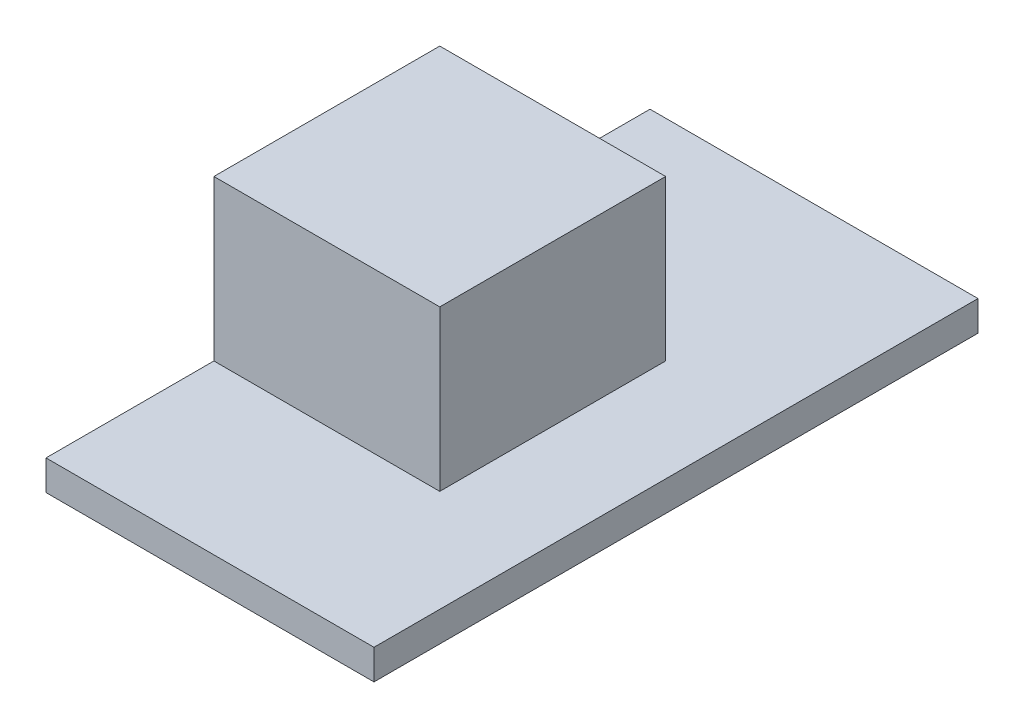
ISO-10303-21;
HEADER;
FILE_DESCRIPTION(('STEP AP214'),'2;1');
FILE_NAME('part.step','',(''),(''),'','','');
FILE_SCHEMA(('AUTOMOTIVE_DESIGN { 1 0 10303 214 1 1 1 1 }'));
ENDSEC;
DATA;
#1=APPLICATION_CONTEXT('core data for automotive mechanical design processes');
#2=APPLICATION_PROTOCOL_DEFINITION('international standard','automotive_design',2000,#1);
#3=PRODUCT_CONTEXT('',#1,'mechanical');
#4=PRODUCT('Part','Part','',(#3));
#5=PRODUCT_RELATED_PRODUCT_CATEGORY('part','',(#4));
#6=PRODUCT_DEFINITION_FORMATION('','',#4);
#7=PRODUCT_DEFINITION_CONTEXT('part definition',#1,'design');
#8=PRODUCT_DEFINITION('design','',#6,#7);
#9=PRODUCT_DEFINITION_SHAPE('','',#8);
#10=(LENGTH_UNIT() NAMED_UNIT(*) SI_UNIT(.MILLI.,.METRE.));
#11=(NAMED_UNIT(*) PLANE_ANGLE_UNIT() SI_UNIT($,.RADIAN.));
#12=(NAMED_UNIT(*) SI_UNIT($,.STERADIAN.) SOLID_ANGLE_UNIT());
#13=UNCERTAINTY_MEASURE_WITH_UNIT(LENGTH_MEASURE(1.E-05),#10,'distance_accuracy_value','');
#14=(GEOMETRIC_REPRESENTATION_CONTEXT(3) GLOBAL_UNCERTAINTY_ASSIGNED_CONTEXT((#13)) GLOBAL_UNIT_ASSIGNED_CONTEXT((#10,
#11,#12)) REPRESENTATION_CONTEXT('',''));
#15=CARTESIAN_POINT('',(0.,0.,0.));
#16=DIRECTION('',(0.,0.,1.));
#17=DIRECTION('',(1.,0.,0.));
#18=AXIS2_PLACEMENT_3D('',#15,#16,#17);
#19=CARTESIAN_POINT('',(5.46,1.,-10.055));
#20=DIRECTION('',(-1.,0.,0.));
#21=DIRECTION('',(0.,0.,1.));
#22=AXIS2_PLACEMENT_3D('',#19,#20,#21);
#23=PLANE('',#22);
#24=DIRECTION('',(0.,0.,-1.));
#25=VECTOR('',#24,1.);
#26=CARTESIAN_POINT('',(5.46,0.,-10.055));
#27=LINE('',#26,#25);
#28=CARTESIAN_POINT('',(5.46,0.,10.055));
#29=VERTEX_POINT('',#28);
#30=CARTESIAN_POINT('',(5.46,0.,-10.055));
#31=VERTEX_POINT('',#30);
#32=EDGE_CURVE('E119',#29,#31,#27,.T.);
#33=ORIENTED_EDGE('',*,*,#32,.T.);
#34=DIRECTION('',(0.,-1.,0.));
#35=VECTOR('',#34,1.);
#36=CARTESIAN_POINT('',(5.46,1.,-10.055));
#37=LINE('',#36,#35);
#38=CARTESIAN_POINT('',(5.46,1.,-10.055));
#39=VERTEX_POINT('',#38);
#40=EDGE_CURVE('E11',#39,#31,#37,.T.);
#41=ORIENTED_EDGE('',*,*,#40,.F.);
#42=DIRECTION('',(0.,0.,-1.));
#43=VECTOR('',#42,1.);
#44=CARTESIAN_POINT('',(5.46,1.,-10.055));
#45=LINE('',#44,#43);
#46=CARTESIAN_POINT('',(5.46,1.,10.055));
#47=VERTEX_POINT('',#46);
#48=EDGE_CURVE('E128',#47,#39,#45,.T.);
#49=ORIENTED_EDGE('',*,*,#48,.F.);
#50=DIRECTION('',(0.,-1.,0.));
#51=VECTOR('',#50,1.);
#52=CARTESIAN_POINT('',(5.46,1.,10.055));
#53=LINE('',#52,#51);
#54=EDGE_CURVE('E137',#47,#29,#53,.T.);
#55=ORIENTED_EDGE('',*,*,#54,.T.);
#56=EDGE_LOOP('',(#33,#41,#49,#55));
#57=FACE_BOUND('',#56,.T.);
#58=ADVANCED_FACE('F33',(#57),#23,.F.);
#59=CARTESIAN_POINT('',(-5.46,1.,-10.055));
#60=DIRECTION('',(0.,0.,1.));
#61=DIRECTION('',(1.,0.,0.));
#62=AXIS2_PLACEMENT_3D('',#59,#60,#61);
#63=PLANE('',#62);
#64=DIRECTION('',(-1.,0.,0.));
#65=VECTOR('',#64,1.);
#66=CARTESIAN_POINT('',(-5.46,0.,-10.055));
#67=LINE('',#66,#65);
#68=CARTESIAN_POINT('',(-5.46,0.,-10.055));
#69=VERTEX_POINT('',#68);
#70=EDGE_CURVE('E122',#31,#69,#67,.T.);
#71=ORIENTED_EDGE('',*,*,#70,.T.);
#72=DIRECTION('',(0.,-1.,0.));
#73=VECTOR('',#72,1.);
#74=CARTESIAN_POINT('',(-5.46,1.,-10.055));
#75=LINE('',#74,#73);
#76=CARTESIAN_POINT('',(-5.46,1.,-10.055));
#77=VERTEX_POINT('',#76);
#78=EDGE_CURVE('E40',#77,#69,#75,.T.);
#79=ORIENTED_EDGE('',*,*,#78,.F.);
#80=DIRECTION('',(-1.,0.,0.));
#81=VECTOR('',#80,1.);
#82=CARTESIAN_POINT('',(-5.46,1.,-10.055));
#83=LINE('',#82,#81);
#84=EDGE_CURVE('E131',#39,#77,#83,.T.);
#85=ORIENTED_EDGE('',*,*,#84,.F.);
#86=ORIENTED_EDGE('',*,*,#40,.T.);
#87=EDGE_LOOP('',(#71,#79,#85,#86));
#88=FACE_BOUND('',#87,.T.);
#89=ADVANCED_FACE('F164',(#88),#63,.F.);
#90=CARTESIAN_POINT('',(-5.46,1.,-10.055));
#91=DIRECTION('',(1.,0.,0.));
#92=DIRECTION('',(0.,0.,-1.));
#93=AXIS2_PLACEMENT_3D('',#90,#91,#92);
#94=PLANE('',#93);
#95=DIRECTION('',(0.,0.,1.));
#96=VECTOR('',#95,1.);
#97=CARTESIAN_POINT('',(-5.46,0.,-10.055));
#98=LINE('',#97,#96);
#99=CARTESIAN_POINT('',(-5.46,0.,10.055));
#100=VERTEX_POINT('',#99);
#101=EDGE_CURVE('E140',#69,#100,#98,.T.);
#102=ORIENTED_EDGE('',*,*,#101,.T.);
#103=DIRECTION('',(0.,-1.,0.));
#104=VECTOR('',#103,1.);
#105=CARTESIAN_POINT('',(-5.46,1.,10.055));
#106=LINE('',#105,#104);
#107=CARTESIAN_POINT('',(-5.46,1.,10.055));
#108=VERTEX_POINT('',#107);
#109=EDGE_CURVE('E145',#108,#100,#106,.T.);
#110=ORIENTED_EDGE('',*,*,#109,.F.);
#111=DIRECTION('',(0.,0.,1.));
#112=VECTOR('',#111,1.);
#113=CARTESIAN_POINT('',(-5.46,1.,-10.055));
#114=LINE('',#113,#112);
#115=CARTESIAN_POINT('',(-5.46,1.,4.465));
#116=VERTEX_POINT('',#115);
#117=EDGE_CURVE('E118',#116,#108,#114,.T.);
#118=ORIENTED_EDGE('',*,*,#117,.F.);
#119=DIRECTION('',(0.,-1.,0.));
#120=VECTOR('',#119,1.);
#121=CARTESIAN_POINT('',(-5.46,6.32,4.465));
#122=LINE('',#121,#120);
#123=CARTESIAN_POINT('',(-5.46,6.32,4.465));
#124=VERTEX_POINT('',#123);
#125=EDGE_CURVE('E100',#124,#116,#122,.T.);
#126=ORIENTED_EDGE('',*,*,#125,.F.);
#127=DIRECTION('',(0.,0.,1.));
#128=VECTOR('',#127,1.);
#129=CARTESIAN_POINT('',(-5.46,6.32,4.465));
#130=LINE('',#129,#128);
#131=CARTESIAN_POINT('',(-5.46,6.32,-3.055));
#132=VERTEX_POINT('',#131);
#133=EDGE_CURVE('E106',#132,#124,#130,.T.);
#134=ORIENTED_EDGE('',*,*,#133,.F.);
#135=DIRECTION('',(0.,-1.,0.));
#136=VECTOR('',#135,1.);
#137=CARTESIAN_POINT('',(-5.46,6.32,-3.055));
#138=LINE('',#137,#136);
#139=CARTESIAN_POINT('',(-5.46,1.,-3.055));
#140=VERTEX_POINT('',#139);
#141=EDGE_CURVE('E251',#132,#140,#138,.T.);
#142=ORIENTED_EDGE('',*,*,#141,.T.);
#143=EDGE_CURVE('E134',#77,#140,#114,.T.);
#144=ORIENTED_EDGE('',*,*,#143,.F.);
#145=ORIENTED_EDGE('',*,*,#78,.T.);
#146=EDGE_LOOP('',(#102,#110,#118,#126,#134,#142,#144,#145));
#147=FACE_BOUND('',#146,.T.);
#148=ADVANCED_FACE('F116',(#147),#94,.F.);
#149=CARTESIAN_POINT('',(-5.46,1.,10.055));
#150=DIRECTION('',(0.,0.,-1.));
#151=DIRECTION('',(-1.,0.,0.));
#152=AXIS2_PLACEMENT_3D('',#149,#150,#151);
#153=PLANE('',#152);
#154=DIRECTION('',(1.,0.,0.));
#155=VECTOR('',#154,1.);
#156=CARTESIAN_POINT('',(-5.46,0.,10.055));
#157=LINE('',#156,#155);
#158=EDGE_CURVE('E132',#100,#29,#157,.T.);
#159=ORIENTED_EDGE('',*,*,#158,.T.);
#160=ORIENTED_EDGE('',*,*,#54,.F.);
#161=DIRECTION('',(1.,0.,0.));
#162=VECTOR('',#161,1.);
#163=CARTESIAN_POINT('',(-5.46,1.,10.055));
#164=LINE('',#163,#162);
#165=EDGE_CURVE('E136',#108,#47,#164,.T.);
#166=ORIENTED_EDGE('',*,*,#165,.F.);
#167=ORIENTED_EDGE('',*,*,#109,.T.);
#168=EDGE_LOOP('',(#159,#160,#166,#167));
#169=FACE_BOUND('',#168,.T.);
#170=ADVANCED_FACE('F158',(#169),#153,.F.);
#171=CARTESIAN_POINT('',(0.,1.,0.));
#172=DIRECTION('',(0.,1.,0.));
#173=DIRECTION('',(0.,0.,1.));
#174=AXIS2_PLACEMENT_3D('',#171,#172,#173);
#175=PLANE('',#174);
#176=DIRECTION('',(-1.,0.,0.));
#177=VECTOR('',#176,1.);
#178=CARTESIAN_POINT('',(-5.46,1.,-3.055));
#179=LINE('',#178,#177);
#180=CARTESIAN_POINT('',(2.06,1.,-3.055));
#181=VERTEX_POINT('',#180);
#182=EDGE_CURVE('E47',#181,#140,#179,.T.);
#183=ORIENTED_EDGE('',*,*,#182,.F.);
#184=DIRECTION('',(0.,0.,-1.));
#185=VECTOR('',#184,1.);
#186=CARTESIAN_POINT('',(2.06,1.,-3.055));
#187=LINE('',#186,#185);
#188=CARTESIAN_POINT('',(2.06,1.,4.465));
#189=VERTEX_POINT('',#188);
#190=EDGE_CURVE('E253',#189,#181,#187,.T.);
#191=ORIENTED_EDGE('',*,*,#190,.F.);
#192=DIRECTION('',(1.,0.,0.));
#193=VECTOR('',#192,1.);
#194=CARTESIAN_POINT('',(2.06,1.,4.465));
#195=LINE('',#194,#193);
#196=EDGE_CURVE('E53',#116,#189,#195,.T.);
#197=ORIENTED_EDGE('',*,*,#196,.F.);
#198=ORIENTED_EDGE('',*,*,#117,.T.);
#199=ORIENTED_EDGE('',*,*,#165,.T.);
#200=ORIENTED_EDGE('',*,*,#48,.T.);
#201=ORIENTED_EDGE('',*,*,#84,.T.);
#202=ORIENTED_EDGE('',*,*,#143,.T.);
#203=EDGE_LOOP('',(#183,#191,#197,#198,#199,#200,#201,#202));
#204=FACE_BOUND('',#203,.T.);
#205=ADVANCED_FACE('F163',(#204),#175,.T.);
#206=CARTESIAN_POINT('',(0.,0.,0.));
#207=DIRECTION('',(0.,1.,0.));
#208=DIRECTION('',(0.,0.,1.));
#209=AXIS2_PLACEMENT_3D('',#206,#207,#208);
#210=PLANE('',#209);
#211=ORIENTED_EDGE('',*,*,#32,.F.);
#212=ORIENTED_EDGE('',*,*,#158,.F.);
#213=ORIENTED_EDGE('',*,*,#101,.F.);
#214=ORIENTED_EDGE('',*,*,#70,.F.);
#215=EDGE_LOOP('',(#211,#212,#213,#214));
#216=FACE_BOUND('',#215,.T.);
#217=ADVANCED_FACE('F155',(#216),#210,.F.);
#218=CARTESIAN_POINT('',(2.06,6.32,4.465));
#219=DIRECTION('',(0.,0.,-1.));
#220=DIRECTION('',(-1.,0.,0.));
#221=AXIS2_PLACEMENT_3D('',#218,#219,#220);
#222=PLANE('',#221);
#223=ORIENTED_EDGE('',*,*,#196,.T.);
#224=DIRECTION('',(0.,-1.,0.));
#225=VECTOR('',#224,1.);
#226=CARTESIAN_POINT('',(2.06,6.32,4.465));
#227=LINE('',#226,#225);
#228=CARTESIAN_POINT('',(2.06,6.32,4.465));
#229=VERTEX_POINT('',#228);
#230=EDGE_CURVE('E102',#229,#189,#227,.T.);
#231=ORIENTED_EDGE('',*,*,#230,.F.);
#232=DIRECTION('',(1.,0.,0.));
#233=VECTOR('',#232,1.);
#234=CARTESIAN_POINT('',(2.06,6.32,4.465));
#235=LINE('',#234,#233);
#236=EDGE_CURVE('E96',#124,#229,#235,.T.);
#237=ORIENTED_EDGE('',*,*,#236,.F.);
#238=ORIENTED_EDGE('',*,*,#125,.T.);
#239=EDGE_LOOP('',(#223,#231,#237,#238));
#240=FACE_BOUND('',#239,.T.);
#241=ADVANCED_FACE('F98',(#240),#222,.F.);
#242=CARTESIAN_POINT('',(2.06,6.32,-3.055));
#243=DIRECTION('',(-1.,0.,0.));
#244=DIRECTION('',(0.,0.,1.));
#245=AXIS2_PLACEMENT_3D('',#242,#243,#244);
#246=PLANE('',#245);
#247=ORIENTED_EDGE('',*,*,#190,.T.);
#248=DIRECTION('',(0.,-1.,0.));
#249=VECTOR('',#248,1.);
#250=CARTESIAN_POINT('',(2.06,6.32,-3.055));
#251=LINE('',#250,#249);
#252=CARTESIAN_POINT('',(2.06,6.32,-3.055));
#253=VERTEX_POINT('',#252);
#254=EDGE_CURVE('E124',#253,#181,#251,.T.);
#255=ORIENTED_EDGE('',*,*,#254,.F.);
#256=DIRECTION('',(0.,0.,-1.));
#257=VECTOR('',#256,1.);
#258=CARTESIAN_POINT('',(2.06,6.32,-3.055));
#259=LINE('',#258,#257);
#260=EDGE_CURVE('E105',#229,#253,#259,.T.);
#261=ORIENTED_EDGE('',*,*,#260,.F.);
#262=ORIENTED_EDGE('',*,*,#230,.T.);
#263=EDGE_LOOP('',(#247,#255,#261,#262));
#264=FACE_BOUND('',#263,.T.);
#265=ADVANCED_FACE('F180',(#264),#246,.F.);
#266=CARTESIAN_POINT('',(-5.46,6.32,-3.055));
#267=DIRECTION('',(0.,0.,1.));
#268=DIRECTION('',(1.,0.,0.));
#269=AXIS2_PLACEMENT_3D('',#266,#267,#268);
#270=PLANE('',#269);
#271=ORIENTED_EDGE('',*,*,#182,.T.);
#272=ORIENTED_EDGE('',*,*,#141,.F.);
#273=DIRECTION('',(-1.,0.,0.));
#274=VECTOR('',#273,1.);
#275=CARTESIAN_POINT('',(-5.46,6.32,-3.055));
#276=LINE('',#275,#274);
#277=EDGE_CURVE('E111',#253,#132,#276,.T.);
#278=ORIENTED_EDGE('',*,*,#277,.F.);
#279=ORIENTED_EDGE('',*,*,#254,.T.);
#280=EDGE_LOOP('',(#271,#272,#278,#279));
#281=FACE_BOUND('',#280,.T.);
#282=ADVANCED_FACE('F183',(#281),#270,.F.);
#283=CARTESIAN_POINT('',(0.,6.32,0.));
#284=DIRECTION('',(0.,-1.,0.));
#285=DIRECTION('',(0.,0.,-1.));
#286=AXIS2_PLACEMENT_3D('',#283,#284,#285);
#287=PLANE('',#286);
#288=ORIENTED_EDGE('',*,*,#133,.T.);
#289=ORIENTED_EDGE('',*,*,#236,.T.);
#290=ORIENTED_EDGE('',*,*,#260,.T.);
#291=ORIENTED_EDGE('',*,*,#277,.T.);
#292=EDGE_LOOP('',(#288,#289,#290,#291));
#293=FACE_BOUND('',#292,.T.);
#294=ADVANCED_FACE('F109',(#293),#287,.F.);
#295=CLOSED_SHELL('',(#58,#89,#148,#170,#205,#217,#241,#265,#282,#294));
#296=MANIFOLD_SOLID_BREP('B2',#295);
#297=ADVANCED_BREP_SHAPE_REPRESENTATION('',(#18,#296),#14);
#298=SHAPE_DEFINITION_REPRESENTATION(#9,#297);
ENDSEC;
END-ISO-10303-21;
